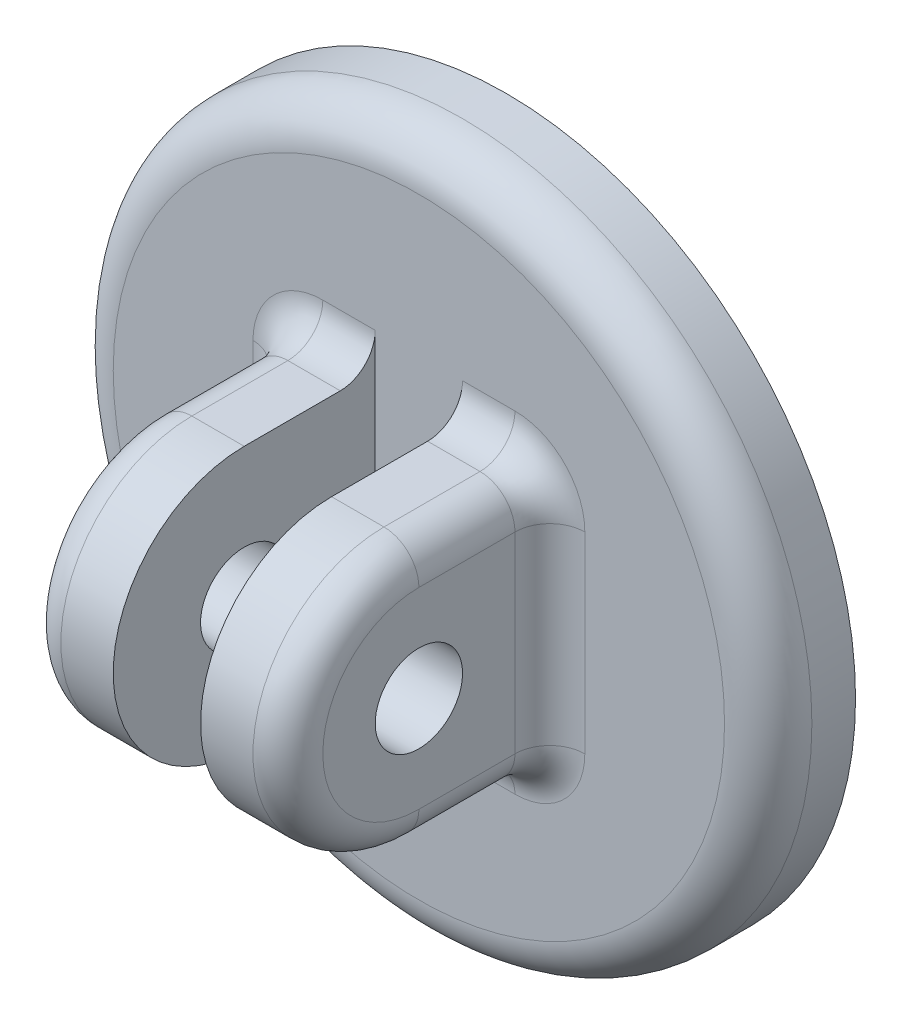
ISO-10303-21;
HEADER;
FILE_DESCRIPTION(('STEP AP214'),'2;1');
FILE_NAME('part.step','',(''),(''),'','','');
FILE_SCHEMA(('AUTOMOTIVE_DESIGN { 1 0 10303 214 1 1 1 1 }'));
ENDSEC;
DATA;
#1=APPLICATION_CONTEXT('core data for automotive mechanical design processes');
#2=APPLICATION_PROTOCOL_DEFINITION('international standard','automotive_design',2000,#1);
#3=PRODUCT_CONTEXT('',#1,'mechanical');
#4=PRODUCT('Part','Part','',(#3));
#5=PRODUCT_RELATED_PRODUCT_CATEGORY('part','',(#4));
#6=PRODUCT_DEFINITION_FORMATION('','',#4);
#7=PRODUCT_DEFINITION_CONTEXT('part definition',#1,'design');
#8=PRODUCT_DEFINITION('design','',#6,#7);
#9=PRODUCT_DEFINITION_SHAPE('','',#8);
#10=(LENGTH_UNIT() NAMED_UNIT(*) SI_UNIT(.MILLI.,.METRE.));
#11=(NAMED_UNIT(*) PLANE_ANGLE_UNIT() SI_UNIT($,.RADIAN.));
#12=(NAMED_UNIT(*) SI_UNIT($,.STERADIAN.) SOLID_ANGLE_UNIT());
#13=UNCERTAINTY_MEASURE_WITH_UNIT(LENGTH_MEASURE(1.E-05),#10,'distance_accuracy_value','');
#14=(GEOMETRIC_REPRESENTATION_CONTEXT(3) GLOBAL_UNCERTAINTY_ASSIGNED_CONTEXT((#13)) GLOBAL_UNIT_ASSIGNED_CONTEXT((#10,
#11,#12)) REPRESENTATION_CONTEXT('',''));
#15=CARTESIAN_POINT('',(0.,0.,0.));
#16=DIRECTION('',(0.,0.,1.));
#17=DIRECTION('',(1.,0.,0.));
#18=AXIS2_PLACEMENT_3D('',#15,#16,#17);
#19=CARTESIAN_POINT('',(0.,0.,5.));
#20=DIRECTION('',(0.,0.,1.));
#21=DIRECTION('',(1.,0.,0.));
#22=AXIS2_PLACEMENT_3D('',#19,#20,#21);
#23=PLANE('',#22);
#24=CARTESIAN_POINT('',(0.,0.,5.));
#25=DIRECTION('',(0.,0.,1.));
#26=DIRECTION('',(1.,0.,0.));
#27=AXIS2_PLACEMENT_3D('',#24,#25,#26);
#28=CIRCLE('',#27,17.5);
#29=CARTESIAN_POINT('',(17.5,0.,5.));
#30=VERTEX_POINT('',#29);
#31=EDGE_CURVE('E91',#30,#30,#28,.T.);
#32=ORIENTED_EDGE('',*,*,#31,.T.);
#33=EDGE_LOOP('',(#32));
#34=FACE_BOUND('',#33,.T.);
#35=DIRECTION('',(1.,0.,0.));
#36=VECTOR('',#35,1.);
#37=CARTESIAN_POINT('',(0.,9.5,5.));
#38=LINE('',#37,#36);
#39=CARTESIAN_POINT('',(-5.5,9.5,5.));
#40=VERTEX_POINT('',#39);
#41=CARTESIAN_POINT('',(-2.5,9.5,5.));
#42=VERTEX_POINT('',#41);
#43=EDGE_CURVE('E340',#40,#42,#38,.T.);
#44=ORIENTED_EDGE('',*,*,#43,.T.);
#45=DIRECTION('',(0.,-1.,0.));
#46=VECTOR('',#45,1.);
#47=CARTESIAN_POINT('',(-2.5,-7.5,5.));
#48=LINE('',#47,#46);
#49=CARTESIAN_POINT('',(-2.5,0.,5.));
#50=VERTEX_POINT('',#49);
#51=EDGE_CURVE('E236',#42,#50,#48,.T.);
#52=ORIENTED_EDGE('',*,*,#51,.T.);
#53=CARTESIAN_POINT('',(0.,0.,5.));
#54=DIRECTION('',(0.,0.,1.));
#55=DIRECTION('',(1.,0.,0.));
#56=AXIS2_PLACEMENT_3D('',#53,#54,#55);
#57=CIRCLE('',#56,2.5);
#58=CARTESIAN_POINT('',(2.5,0.,5.));
#59=VERTEX_POINT('',#58);
#60=EDGE_CURVE('E294',#59,#50,#57,.T.);
#61=ORIENTED_EDGE('',*,*,#60,.F.);
#62=DIRECTION('',(0.,-1.,0.));
#63=VECTOR('',#62,1.);
#64=CARTESIAN_POINT('',(2.5,-7.5,5.));
#65=LINE('',#64,#63);
#66=CARTESIAN_POINT('',(2.5,9.5,5.));
#67=VERTEX_POINT('',#66);
#68=EDGE_CURVE('E275',#67,#59,#65,.T.);
#69=ORIENTED_EDGE('',*,*,#68,.F.);
#70=DIRECTION('',(-1.,0.,0.));
#71=VECTOR('',#70,1.);
#72=CARTESIAN_POINT('',(0.,9.5,5.));
#73=LINE('',#72,#71);
#74=CARTESIAN_POINT('',(5.5,9.5,5.));
#75=VERTEX_POINT('',#74);
#76=EDGE_CURVE('E323',#67,#75,#73,.F.);
#77=ORIENTED_EDGE('',*,*,#76,.T.);
#78=CARTESIAN_POINT('',(5.5,5.5,5.));
#79=DIRECTION('',(0.,0.,1.));
#80=DIRECTION('',(1.,0.,0.));
#81=AXIS2_PLACEMENT_3D('',#78,#79,#80);
#82=CIRCLE('',#81,4.);
#83=CARTESIAN_POINT('',(9.5,5.5,5.));
#84=VERTEX_POINT('',#83);
#85=EDGE_CURVE('E319',#84,#75,#82,.T.);
#86=ORIENTED_EDGE('',*,*,#85,.F.);
#87=DIRECTION('',(0.,1.,0.));
#88=VECTOR('',#87,1.);
#89=CARTESIAN_POINT('',(9.5,0.,5.));
#90=LINE('',#89,#88);
#91=CARTESIAN_POINT('',(9.5,-5.5,5.));
#92=VERTEX_POINT('',#91);
#93=EDGE_CURVE('E316',#84,#92,#90,.F.);
#94=ORIENTED_EDGE('',*,*,#93,.T.);
#95=CARTESIAN_POINT('',(5.5,-5.5,5.));
#96=DIRECTION('',(0.,0.,1.));
#97=DIRECTION('',(1.,0.,0.));
#98=AXIS2_PLACEMENT_3D('',#95,#96,#97);
#99=CIRCLE('',#98,4.);
#100=CARTESIAN_POINT('',(5.5,-9.5,5.));
#101=VERTEX_POINT('',#100);
#102=EDGE_CURVE('E312',#101,#92,#99,.T.);
#103=ORIENTED_EDGE('',*,*,#102,.F.);
#104=DIRECTION('',(1.,0.,0.));
#105=VECTOR('',#104,1.);
#106=CARTESIAN_POINT('',(0.,-9.5,5.));
#107=LINE('',#106,#105);
#108=CARTESIAN_POINT('',(2.5,-9.5,5.));
#109=VERTEX_POINT('',#108);
#110=EDGE_CURVE('E308',#101,#109,#107,.F.);
#111=ORIENTED_EDGE('',*,*,#110,.T.);
#112=EDGE_CURVE('E280',#59,#109,#65,.T.);
#113=ORIENTED_EDGE('',*,*,#112,.F.);
#114=EDGE_CURVE('E288',#50,#59,#57,.T.);
#115=ORIENTED_EDGE('',*,*,#114,.F.);
#116=CARTESIAN_POINT('',(-2.5,-9.5,5.));
#117=VERTEX_POINT('',#116);
#118=EDGE_CURVE('E252',#50,#117,#48,.T.);
#119=ORIENTED_EDGE('',*,*,#118,.T.);
#120=DIRECTION('',(-1.,0.,0.));
#121=VECTOR('',#120,1.);
#122=CARTESIAN_POINT('',(0.,-9.5,5.));
#123=LINE('',#122,#121);
#124=CARTESIAN_POINT('',(-5.5,-9.5,5.));
#125=VERTEX_POINT('',#124);
#126=EDGE_CURVE('E326',#117,#125,#123,.T.);
#127=ORIENTED_EDGE('',*,*,#126,.T.);
#128=CARTESIAN_POINT('',(-5.5,-5.5,5.));
#129=DIRECTION('',(0.,0.,1.));
#130=DIRECTION('',(1.,0.,0.));
#131=AXIS2_PLACEMENT_3D('',#128,#129,#130);
#132=CIRCLE('',#131,4.);
#133=CARTESIAN_POINT('',(-9.5,-5.5,5.));
#134=VERTEX_POINT('',#133);
#135=EDGE_CURVE('E329',#134,#125,#132,.T.);
#136=ORIENTED_EDGE('',*,*,#135,.F.);
#137=DIRECTION('',(0.,1.,0.));
#138=VECTOR('',#137,1.);
#139=CARTESIAN_POINT('',(-9.5,0.,5.));
#140=LINE('',#139,#138);
#141=CARTESIAN_POINT('',(-9.5,5.5,5.));
#142=VERTEX_POINT('',#141);
#143=EDGE_CURVE('E333',#134,#142,#140,.T.);
#144=ORIENTED_EDGE('',*,*,#143,.T.);
#145=CARTESIAN_POINT('',(-5.5,5.5,5.));
#146=DIRECTION('',(0.,0.,1.));
#147=DIRECTION('',(1.,0.,0.));
#148=AXIS2_PLACEMENT_3D('',#145,#146,#147);
#149=CIRCLE('',#148,4.);
#150=EDGE_CURVE('E336',#40,#142,#149,.T.);
#151=ORIENTED_EDGE('',*,*,#150,.F.);
#152=EDGE_LOOP('',(#44,#52,#61,#69,#77,#86,#94,#103,#111,#113,#115,#119,#127,#136,#144,#151));
#153=FACE_BOUND('',#152,.T.);
#154=ADVANCED_FACE('F82',(#34,#153),#23,.T.);
#155=CARTESIAN_POINT('',(2.5,-7.5,20.));
#156=DIRECTION('',(1.,0.,0.));
#157=DIRECTION('',(0.,0.,-1.));
#158=AXIS2_PLACEMENT_3D('',#155,#156,#157);
#159=PLANE('',#158);
#160=CARTESIAN_POINT('',(2.5,0.,12.5));
#161=DIRECTION('',(1.,0.,0.));
#162=DIRECTION('',(0.,1.,0.));
#163=AXIS2_PLACEMENT_3D('',#160,#161,#162);
#164=CIRCLE('',#163,2.5);
#165=CARTESIAN_POINT('',(2.5,2.5,12.5));
#166=VERTEX_POINT('',#165);
#167=EDGE_CURVE('E260',#166,#166,#164,.T.);
#168=ORIENTED_EDGE('',*,*,#167,.T.);
#169=EDGE_LOOP('',(#168));
#170=FACE_BOUND('',#169,.T.);
#171=CARTESIAN_POINT('',(2.5,0.,12.5));
#172=DIRECTION('',(1.,0.,0.));
#173=DIRECTION('',(0.,1.,0.));
#174=AXIS2_PLACEMENT_3D('',#171,#172,#173);
#175=CIRCLE('',#174,7.5);
#176=CARTESIAN_POINT('',(2.5,7.5,12.5));
#177=VERTEX_POINT('',#176);
#178=CARTESIAN_POINT('',(2.5,-7.5,12.5));
#179=VERTEX_POINT('',#178);
#180=EDGE_CURVE('E265',#177,#179,#175,.T.);
#181=ORIENTED_EDGE('',*,*,#180,.F.);
#182=DIRECTION('',(0.,0.,-1.));
#183=VECTOR('',#182,1.);
#184=CARTESIAN_POINT('',(2.5,7.5,20.));
#185=LINE('',#184,#183);
#186=CARTESIAN_POINT('',(2.5,7.5,7.));
#187=VERTEX_POINT('',#186);
#188=EDGE_CURVE('E279',#177,#187,#185,.T.);
#189=ORIENTED_EDGE('',*,*,#188,.T.);
#190=CARTESIAN_POINT('',(2.5,9.5,7.));
#191=DIRECTION('',(1.,0.,0.));
#192=DIRECTION('',(0.,0.,-1.));
#193=AXIS2_PLACEMENT_3D('',#190,#191,#192);
#194=CIRCLE('',#193,2.);
#195=EDGE_CURVE('E391',#187,#67,#194,.T.);
#196=ORIENTED_EDGE('',*,*,#195,.T.);
#197=ORIENTED_EDGE('',*,*,#68,.T.);
#198=ORIENTED_EDGE('',*,*,#112,.T.);
#199=CARTESIAN_POINT('',(2.5,-9.5,7.));
#200=DIRECTION('',(1.,0.,0.));
#201=DIRECTION('',(0.,0.,-1.));
#202=AXIS2_PLACEMENT_3D('',#199,#200,#201);
#203=CIRCLE('',#202,2.);
#204=CARTESIAN_POINT('',(2.5,-7.5,7.));
#205=VERTEX_POINT('',#204);
#206=EDGE_CURVE('E401',#109,#205,#203,.T.);
#207=ORIENTED_EDGE('',*,*,#206,.T.);
#208=DIRECTION('',(0.,0.,-1.));
#209=VECTOR('',#208,1.);
#210=CARTESIAN_POINT('',(2.5,-7.5,20.));
#211=LINE('',#210,#209);
#212=EDGE_CURVE('E284',#179,#205,#211,.T.);
#213=ORIENTED_EDGE('',*,*,#212,.F.);
#214=EDGE_LOOP('',(#181,#189,#196,#197,#198,#207,#213));
#215=FACE_BOUND('',#214,.T.);
#216=ADVANCED_FACE('F481',(#170,#215),#159,.F.);
#217=CARTESIAN_POINT('',(7.5,-7.5,20.));
#218=DIRECTION('',(-1.,0.,0.));
#219=DIRECTION('',(0.,-1.,0.));
#220=AXIS2_PLACEMENT_3D('',#217,#218,#219);
#221=PLANE('',#220);
#222=DIRECTION('',(0.,0.,-1.));
#223=VECTOR('',#222,1.);
#224=CARTESIAN_POINT('',(7.5,-5.5,20.));
#225=LINE('',#224,#223);
#226=CARTESIAN_POINT('',(7.5,-5.5,12.5));
#227=VERTEX_POINT('',#226);
#228=CARTESIAN_POINT('',(7.5,-5.5,7.));
#229=VERTEX_POINT('',#228);
#230=EDGE_CURVE('E352',#227,#229,#225,.T.);
#231=ORIENTED_EDGE('',*,*,#230,.T.);
#232=DIRECTION('',(0.,1.,0.));
#233=VECTOR('',#232,1.);
#234=CARTESIAN_POINT('',(7.5,-7.5,7.));
#235=LINE('',#234,#233);
#236=CARTESIAN_POINT('',(7.5,5.5,7.));
#237=VERTEX_POINT('',#236);
#238=EDGE_CURVE('E358',#229,#237,#235,.T.);
#239=ORIENTED_EDGE('',*,*,#238,.T.);
#240=DIRECTION('',(0.,0.,-1.));
#241=VECTOR('',#240,1.);
#242=CARTESIAN_POINT('',(7.5,5.5,20.));
#243=LINE('',#242,#241);
#244=CARTESIAN_POINT('',(7.5,5.5,12.5));
#245=VERTEX_POINT('',#244);
#246=EDGE_CURVE('E355',#237,#245,#243,.F.);
#247=ORIENTED_EDGE('',*,*,#246,.T.);
#248=CARTESIAN_POINT('',(7.5,0.,12.5));
#249=DIRECTION('',(-1.,0.,0.));
#250=DIRECTION('',(0.,-1.,0.));
#251=AXIS2_PLACEMENT_3D('',#248,#249,#250);
#252=CIRCLE('',#251,5.5);
#253=EDGE_CURVE('E349',#245,#227,#252,.F.);
#254=ORIENTED_EDGE('',*,*,#253,.T.);
#255=EDGE_LOOP('',(#231,#239,#247,#254));
#256=FACE_BOUND('',#255,.T.);
#257=CARTESIAN_POINT('',(7.5,0.,12.5));
#258=DIRECTION('',(1.,0.,0.));
#259=DIRECTION('',(0.,1.,0.));
#260=AXIS2_PLACEMENT_3D('',#257,#258,#259);
#261=CIRCLE('',#260,2.5);
#262=CARTESIAN_POINT('',(7.5,2.5,12.5));
#263=VERTEX_POINT('',#262);
#264=EDGE_CURVE('E261',#263,#263,#261,.T.);
#265=ORIENTED_EDGE('',*,*,#264,.F.);
#266=EDGE_LOOP('',(#265));
#267=FACE_BOUND('',#266,.T.);
#268=ADVANCED_FACE('F486',(#256,#267),#221,.F.);
#269=CARTESIAN_POINT('',(2.5,-7.5,20.));
#270=DIRECTION('',(0.,1.,0.));
#271=DIRECTION('',(-1.,0.,0.));
#272=AXIS2_PLACEMENT_3D('',#269,#270,#271);
#273=PLANE('',#272);
#274=DIRECTION('',(1.,0.,0.));
#275=VECTOR('',#274,1.);
#276=CARTESIAN_POINT('',(2.5,-7.5,7.));
#277=LINE('',#276,#275);
#278=CARTESIAN_POINT('',(5.5,-7.5,7.));
#279=VERTEX_POINT('',#278);
#280=EDGE_CURVE('E375',#205,#279,#277,.T.);
#281=ORIENTED_EDGE('',*,*,#280,.T.);
#282=DIRECTION('',(0.,0.,-1.));
#283=VECTOR('',#282,1.);
#284=CARTESIAN_POINT('',(5.5,-7.5,20.));
#285=LINE('',#284,#283);
#286=CARTESIAN_POINT('',(5.5,-7.5,12.5));
#287=VERTEX_POINT('',#286);
#288=EDGE_CURVE('E378',#279,#287,#285,.F.);
#289=ORIENTED_EDGE('',*,*,#288,.T.);
#290=DIRECTION('',(1.,0.,0.));
#291=VECTOR('',#290,1.);
#292=CARTESIAN_POINT('',(2.5,-7.5,12.5));
#293=LINE('',#292,#291);
#294=EDGE_CURVE('E271',#179,#287,#293,.T.);
#295=ORIENTED_EDGE('',*,*,#294,.F.);
#296=ORIENTED_EDGE('',*,*,#212,.T.);
#297=EDGE_LOOP('',(#281,#289,#295,#296));
#298=FACE_BOUND('',#297,.T.);
#299=ADVANCED_FACE('F499',(#298),#273,.F.);
#300=CARTESIAN_POINT('',(0.,0.,5.));
#301=DIRECTION('',(0.,0.,-1.));
#302=DIRECTION('',(-1.,0.,0.));
#303=AXIS2_PLACEMENT_3D('',#300,#301,#302);
#304=CYLINDRICAL_SURFACE('',#303,20.);
#305=CARTESIAN_POINT('',(0.,0.,2.5));
#306=DIRECTION('',(0.,0.,1.));
#307=DIRECTION('',(1.,0.,0.));
#308=AXIS2_PLACEMENT_3D('',#305,#306,#307);
#309=CIRCLE('',#308,20.);
#310=CARTESIAN_POINT('',(20.,0.,2.5));
#311=VERTEX_POINT('',#310);
#312=EDGE_CURVE('E12',#311,#311,#309,.F.);
#313=ORIENTED_EDGE('',*,*,#312,.T.);
#314=EDGE_LOOP('',(#313));
#315=FACE_BOUND('',#314,.T.);
#316=CARTESIAN_POINT('',(0.,0.,0.));
#317=DIRECTION('',(0.,0.,1.));
#318=DIRECTION('',(1.,0.,0.));
#319=AXIS2_PLACEMENT_3D('',#316,#317,#318);
#320=CIRCLE('',#319,20.);
#321=CARTESIAN_POINT('',(20.,0.,0.));
#322=VERTEX_POINT('',#321);
#323=EDGE_CURVE('E293',#322,#322,#320,.T.);
#324=ORIENTED_EDGE('',*,*,#323,.T.);
#325=EDGE_LOOP('',(#324));
#326=FACE_BOUND('',#325,.T.);
#327=ADVANCED_FACE('F495',(#315,#326),#304,.T.);
#328=CARTESIAN_POINT('',(0.,0.,0.));
#329=DIRECTION('',(0.,0.,1.));
#330=DIRECTION('',(1.,0.,0.));
#331=AXIS2_PLACEMENT_3D('',#328,#329,#330);
#332=PLANE('',#331);
#333=CARTESIAN_POINT('',(0.,0.,0.));
#334=DIRECTION('',(0.,0.,1.));
#335=DIRECTION('',(1.,0.,0.));
#336=AXIS2_PLACEMENT_3D('',#333,#334,#335);
#337=CIRCLE('',#336,2.5);
#338=CARTESIAN_POINT('',(2.5,0.,0.));
#339=VERTEX_POINT('',#338);
#340=EDGE_CURVE('E289',#339,#339,#337,.T.);
#341=ORIENTED_EDGE('',*,*,#340,.T.);
#342=EDGE_LOOP('',(#341));
#343=FACE_BOUND('',#342,.T.);
#344=ORIENTED_EDGE('',*,*,#323,.F.);
#345=EDGE_LOOP('',(#344));
#346=FACE_BOUND('',#345,.T.);
#347=ADVANCED_FACE('F492',(#343,#346),#332,.F.);
#348=CARTESIAN_POINT('',(0.,0.,0.));
#349=DIRECTION('',(0.,0.,1.));
#350=DIRECTION('',(1.,0.,0.));
#351=AXIS2_PLACEMENT_3D('',#348,#349,#350);
#352=CYLINDRICAL_SURFACE('',#351,2.5);
#353=ORIENTED_EDGE('',*,*,#340,.F.);
#354=EDGE_LOOP('',(#353));
#355=FACE_BOUND('',#354,.T.);
#356=ORIENTED_EDGE('',*,*,#60,.T.);
#357=ORIENTED_EDGE('',*,*,#114,.T.);
#358=EDGE_LOOP('',(#356,#357));
#359=FACE_BOUND('',#358,.T.);
#360=ADVANCED_FACE('F491',(#355,#359),#352,.F.);
#361=CARTESIAN_POINT('',(2.5,7.5,20.));
#362=DIRECTION('',(0.,-1.,0.));
#363=DIRECTION('',(1.,0.,0.));
#364=AXIS2_PLACEMENT_3D('',#361,#362,#363);
#365=PLANE('',#364);
#366=DIRECTION('',(0.,0.,-1.));
#367=VECTOR('',#366,1.);
#368=CARTESIAN_POINT('',(5.5,7.5,20.));
#369=LINE('',#368,#367);
#370=CARTESIAN_POINT('',(5.5,7.5,12.5));
#371=VERTEX_POINT('',#370);
#372=CARTESIAN_POINT('',(5.5,7.5,7.));
#373=VERTEX_POINT('',#372);
#374=EDGE_CURVE('E301',#371,#373,#369,.T.);
#375=ORIENTED_EDGE('',*,*,#374,.T.);
#376=DIRECTION('',(-1.,0.,0.));
#377=VECTOR('',#376,1.);
#378=CARTESIAN_POINT('',(2.5,7.5,7.));
#379=LINE('',#378,#377);
#380=EDGE_CURVE('E304',#373,#187,#379,.T.);
#381=ORIENTED_EDGE('',*,*,#380,.T.);
#382=ORIENTED_EDGE('',*,*,#188,.F.);
#383=DIRECTION('',(1.,0.,0.));
#384=VECTOR('',#383,1.);
#385=CARTESIAN_POINT('',(2.5,7.5,12.5));
#386=LINE('',#385,#384);
#387=EDGE_CURVE('E256',#177,#371,#386,.T.);
#388=ORIENTED_EDGE('',*,*,#387,.T.);
#389=EDGE_LOOP('',(#375,#381,#382,#388));
#390=FACE_BOUND('',#389,.T.);
#391=ADVANCED_FACE('F590',(#390),#365,.F.);
#392=CARTESIAN_POINT('',(2.5,0.,12.5));
#393=DIRECTION('',(1.,0.,0.));
#394=DIRECTION('',(0.,1.,0.));
#395=AXIS2_PLACEMENT_3D('',#392,#393,#394);
#396=CYLINDRICAL_SURFACE('',#395,7.5);
#397=ORIENTED_EDGE('',*,*,#294,.T.);
#398=CARTESIAN_POINT('',(5.5,0.,12.5));
#399=DIRECTION('',(-1.,0.,0.));
#400=DIRECTION('',(0.,-1.,0.));
#401=AXIS2_PLACEMENT_3D('',#398,#399,#400);
#402=CIRCLE('',#401,7.5);
#403=EDGE_CURVE('E385',#287,#371,#402,.T.);
#404=ORIENTED_EDGE('',*,*,#403,.T.);
#405=ORIENTED_EDGE('',*,*,#387,.F.);
#406=ORIENTED_EDGE('',*,*,#180,.T.);
#407=EDGE_LOOP('',(#397,#404,#405,#406));
#408=FACE_BOUND('',#407,.T.);
#409=ADVANCED_FACE('F586',(#408),#396,.T.);
#410=CARTESIAN_POINT('',(2.5,0.,12.5));
#411=DIRECTION('',(1.,0.,0.));
#412=DIRECTION('',(0.,1.,0.));
#413=AXIS2_PLACEMENT_3D('',#410,#411,#412);
#414=CYLINDRICAL_SURFACE('',#413,2.5);
#415=ORIENTED_EDGE('',*,*,#167,.F.);
#416=EDGE_LOOP('',(#415));
#417=FACE_BOUND('',#416,.T.);
#418=ORIENTED_EDGE('',*,*,#264,.T.);
#419=EDGE_LOOP('',(#418));
#420=FACE_BOUND('',#419,.T.);
#421=ADVANCED_FACE('F582',(#417,#420),#414,.F.);
#422=CARTESIAN_POINT('',(-2.5,-7.5,20.));
#423=DIRECTION('',(-1.,0.,0.));
#424=DIRECTION('',(0.,0.,-1.));
#425=AXIS2_PLACEMENT_3D('',#422,#423,#424);
#426=PLANE('',#425);
#427=CARTESIAN_POINT('',(-2.5,0.,12.5));
#428=DIRECTION('',(1.,0.,0.));
#429=DIRECTION('',(0.,1.,0.));
#430=AXIS2_PLACEMENT_3D('',#427,#428,#429);
#431=CIRCLE('',#430,2.5);
#432=CARTESIAN_POINT('',(-2.5,2.5,12.5));
#433=VERTEX_POINT('',#432);
#434=EDGE_CURVE('E225',#433,#433,#431,.T.);
#435=ORIENTED_EDGE('',*,*,#434,.F.);
#436=EDGE_LOOP('',(#435));
#437=FACE_BOUND('',#436,.T.);
#438=CARTESIAN_POINT('',(-2.5,0.,12.5));
#439=DIRECTION('',(1.,0.,0.));
#440=DIRECTION('',(0.,1.,0.));
#441=AXIS2_PLACEMENT_3D('',#438,#439,#440);
#442=CIRCLE('',#441,7.5);
#443=CARTESIAN_POINT('',(-2.5,7.5,12.5));
#444=VERTEX_POINT('',#443);
#445=CARTESIAN_POINT('',(-2.5,-7.5,12.5));
#446=VERTEX_POINT('',#445);
#447=EDGE_CURVE('E231',#444,#446,#442,.T.);
#448=ORIENTED_EDGE('',*,*,#447,.T.);
#449=DIRECTION('',(0.,0.,-1.));
#450=VECTOR('',#449,1.);
#451=CARTESIAN_POINT('',(-2.5,-7.5,20.));
#452=LINE('',#451,#450);
#453=CARTESIAN_POINT('',(-2.5,-7.5,7.));
#454=VERTEX_POINT('',#453);
#455=EDGE_CURVE('E235',#446,#454,#452,.T.);
#456=ORIENTED_EDGE('',*,*,#455,.T.);
#457=CARTESIAN_POINT('',(-2.5,-9.5,7.));
#458=DIRECTION('',(-1.,0.,0.));
#459=DIRECTION('',(0.,0.,1.));
#460=AXIS2_PLACEMENT_3D('',#457,#458,#459);
#461=CIRCLE('',#460,2.);
#462=EDGE_CURVE('E397',#454,#117,#461,.T.);
#463=ORIENTED_EDGE('',*,*,#462,.T.);
#464=ORIENTED_EDGE('',*,*,#118,.F.);
#465=ORIENTED_EDGE('',*,*,#51,.F.);
#466=CARTESIAN_POINT('',(-2.5,9.5,7.));
#467=DIRECTION('',(-1.,0.,0.));
#468=DIRECTION('',(0.,0.,1.));
#469=AXIS2_PLACEMENT_3D('',#466,#467,#468);
#470=CIRCLE('',#469,2.);
#471=CARTESIAN_POINT('',(-2.5,7.5,7.));
#472=VERTEX_POINT('',#471);
#473=EDGE_CURVE('E233',#42,#472,#470,.T.);
#474=ORIENTED_EDGE('',*,*,#473,.T.);
#475=DIRECTION('',(0.,0.,-1.));
#476=VECTOR('',#475,1.);
#477=CARTESIAN_POINT('',(-2.5,7.5,20.));
#478=LINE('',#477,#476);
#479=EDGE_CURVE('E217',#444,#472,#478,.T.);
#480=ORIENTED_EDGE('',*,*,#479,.F.);
#481=EDGE_LOOP('',(#448,#456,#463,#464,#465,#474,#480));
#482=FACE_BOUND('',#481,.T.);
#483=ADVANCED_FACE('F230',(#437,#482),#426,.F.);
#484=CARTESIAN_POINT('',(-7.5,-7.5,20.));
#485=DIRECTION('',(1.,0.,0.));
#486=DIRECTION('',(0.,-1.,0.));
#487=AXIS2_PLACEMENT_3D('',#484,#485,#486);
#488=PLANE('',#487);
#489=DIRECTION('',(0.,0.,-1.));
#490=VECTOR('',#489,1.);
#491=CARTESIAN_POINT('',(-7.5,5.5,20.));
#492=LINE('',#491,#490);
#493=CARTESIAN_POINT('',(-7.5,5.5,12.5));
#494=VERTEX_POINT('',#493);
#495=CARTESIAN_POINT('',(-7.5,5.5,7.));
#496=VERTEX_POINT('',#495);
#497=EDGE_CURVE('E368',#494,#496,#492,.T.);
#498=ORIENTED_EDGE('',*,*,#497,.T.);
#499=DIRECTION('',(0.,1.,0.));
#500=VECTOR('',#499,1.);
#501=CARTESIAN_POINT('',(-7.5,-7.5,7.));
#502=LINE('',#501,#500);
#503=CARTESIAN_POINT('',(-7.5,-5.5,7.));
#504=VERTEX_POINT('',#503);
#505=EDGE_CURVE('E371',#496,#504,#502,.F.);
#506=ORIENTED_EDGE('',*,*,#505,.T.);
#507=DIRECTION('',(0.,0.,-1.));
#508=VECTOR('',#507,1.);
#509=CARTESIAN_POINT('',(-7.5,-5.5,20.));
#510=LINE('',#509,#508);
#511=CARTESIAN_POINT('',(-7.5,-5.5,12.5));
#512=VERTEX_POINT('',#511);
#513=EDGE_CURVE('E365',#504,#512,#510,.F.);
#514=ORIENTED_EDGE('',*,*,#513,.T.);
#515=CARTESIAN_POINT('',(-7.5,0.,12.5));
#516=DIRECTION('',(1.,0.,0.));
#517=DIRECTION('',(0.,1.,0.));
#518=AXIS2_PLACEMENT_3D('',#515,#516,#517);
#519=CIRCLE('',#518,5.5);
#520=EDGE_CURVE('E362',#512,#494,#519,.F.);
#521=ORIENTED_EDGE('',*,*,#520,.T.);
#522=EDGE_LOOP('',(#498,#506,#514,#521));
#523=FACE_BOUND('',#522,.T.);
#524=CARTESIAN_POINT('',(-7.5,0.,12.5));
#525=DIRECTION('',(1.,0.,0.));
#526=DIRECTION('',(0.,1.,0.));
#527=AXIS2_PLACEMENT_3D('',#524,#525,#526);
#528=CIRCLE('',#527,2.5);
#529=CARTESIAN_POINT('',(-7.5,2.5,12.5));
#530=VERTEX_POINT('',#529);
#531=EDGE_CURVE('E241',#530,#530,#528,.T.);
#532=ORIENTED_EDGE('',*,*,#531,.T.);
#533=EDGE_LOOP('',(#532));
#534=FACE_BOUND('',#533,.T.);
#535=ADVANCED_FACE('F570',(#523,#534),#488,.F.);
#536=CARTESIAN_POINT('',(-2.5,-7.5,20.));
#537=DIRECTION('',(0.,1.,0.));
#538=DIRECTION('',(1.,0.,0.));
#539=AXIS2_PLACEMENT_3D('',#536,#537,#538);
#540=PLANE('',#539);
#541=DIRECTION('',(-1.,0.,0.));
#542=VECTOR('',#541,1.);
#543=CARTESIAN_POINT('',(-2.5,-7.5,12.5));
#544=LINE('',#543,#542);
#545=CARTESIAN_POINT('',(-5.5,-7.5,12.5));
#546=VERTEX_POINT('',#545);
#547=EDGE_CURVE('E239',#446,#546,#544,.T.);
#548=ORIENTED_EDGE('',*,*,#547,.T.);
#549=DIRECTION('',(0.,0.,-1.));
#550=VECTOR('',#549,1.);
#551=CARTESIAN_POINT('',(-5.5,-7.5,20.));
#552=LINE('',#551,#550);
#553=CARTESIAN_POINT('',(-5.5,-7.5,7.));
#554=VERTEX_POINT('',#553);
#555=EDGE_CURVE('E98',#546,#554,#552,.T.);
#556=ORIENTED_EDGE('',*,*,#555,.T.);
#557=DIRECTION('',(-1.,0.,0.));
#558=VECTOR('',#557,1.);
#559=CARTESIAN_POINT('',(-2.5,-7.5,7.));
#560=LINE('',#559,#558);
#561=EDGE_CURVE('E102',#554,#454,#560,.F.);
#562=ORIENTED_EDGE('',*,*,#561,.T.);
#563=ORIENTED_EDGE('',*,*,#455,.F.);
#564=EDGE_LOOP('',(#548,#556,#562,#563));
#565=FACE_BOUND('',#564,.T.);
#566=ADVANCED_FACE('F568',(#565),#540,.F.);
#567=CARTESIAN_POINT('',(-2.5,7.5,20.));
#568=DIRECTION('',(0.,-1.,0.));
#569=DIRECTION('',(-1.,0.,0.));
#570=AXIS2_PLACEMENT_3D('',#567,#568,#569);
#571=PLANE('',#570);
#572=ORIENTED_EDGE('',*,*,#479,.T.);
#573=DIRECTION('',(1.,0.,0.));
#574=VECTOR('',#573,1.);
#575=CARTESIAN_POINT('',(-2.5,7.5,7.));
#576=LINE('',#575,#574);
#577=CARTESIAN_POINT('',(-5.5,7.5,7.));
#578=VERTEX_POINT('',#577);
#579=EDGE_CURVE('E346',#472,#578,#576,.F.);
#580=ORIENTED_EDGE('',*,*,#579,.T.);
#581=DIRECTION('',(0.,0.,-1.));
#582=VECTOR('',#581,1.);
#583=CARTESIAN_POINT('',(-5.5,7.5,20.));
#584=LINE('',#583,#582);
#585=CARTESIAN_POINT('',(-5.5,7.5,12.5));
#586=VERTEX_POINT('',#585);
#587=EDGE_CURVE('E220',#578,#586,#584,.F.);
#588=ORIENTED_EDGE('',*,*,#587,.T.);
#589=DIRECTION('',(-1.,0.,0.));
#590=VECTOR('',#589,1.);
#591=CARTESIAN_POINT('',(-2.5,7.5,12.5));
#592=LINE('',#591,#590);
#593=EDGE_CURVE('E214',#444,#586,#592,.T.);
#594=ORIENTED_EDGE('',*,*,#593,.F.);
#595=EDGE_LOOP('',(#572,#580,#588,#594));
#596=FACE_BOUND('',#595,.T.);
#597=ADVANCED_FACE('F216',(#596),#571,.F.);
#598=CARTESIAN_POINT('',(-2.5,0.,12.5));
#599=DIRECTION('',(-1.,0.,0.));
#600=DIRECTION('',(0.,1.,0.));
#601=AXIS2_PLACEMENT_3D('',#598,#599,#600);
#602=CYLINDRICAL_SURFACE('',#601,7.5);
#603=ORIENTED_EDGE('',*,*,#593,.T.);
#604=CARTESIAN_POINT('',(-5.5,0.,12.5));
#605=DIRECTION('',(1.,0.,0.));
#606=DIRECTION('',(0.,1.,0.));
#607=AXIS2_PLACEMENT_3D('',#604,#605,#606);
#608=CIRCLE('',#607,7.5);
#609=EDGE_CURVE('E388',#586,#546,#608,.T.);
#610=ORIENTED_EDGE('',*,*,#609,.T.);
#611=ORIENTED_EDGE('',*,*,#547,.F.);
#612=ORIENTED_EDGE('',*,*,#447,.F.);
#613=EDGE_LOOP('',(#603,#610,#611,#612));
#614=FACE_BOUND('',#613,.T.);
#615=ADVANCED_FACE('F238',(#614),#602,.T.);
#616=CARTESIAN_POINT('',(-2.5,0.,12.5));
#617=DIRECTION('',(-1.,0.,0.));
#618=DIRECTION('',(0.,1.,0.));
#619=AXIS2_PLACEMENT_3D('',#616,#617,#618);
#620=CYLINDRICAL_SURFACE('',#619,2.5);
#621=ORIENTED_EDGE('',*,*,#434,.T.);
#622=EDGE_LOOP('',(#621));
#623=FACE_BOUND('',#622,.T.);
#624=ORIENTED_EDGE('',*,*,#531,.F.);
#625=EDGE_LOOP('',(#624));
#626=FACE_BOUND('',#625,.T.);
#627=ADVANCED_FACE('F532',(#623,#626),#620,.F.);
#628=CARTESIAN_POINT('',(2.5,-9.5,7.));
#629=DIRECTION('',(1.,0.,0.));
#630=DIRECTION('',(0.,1.,0.));
#631=AXIS2_PLACEMENT_3D('',#628,#629,#630);
#632=CYLINDRICAL_SURFACE('',#631,2.);
#633=ORIENTED_EDGE('',*,*,#206,.F.);
#634=ORIENTED_EDGE('',*,*,#110,.F.);
#635=CARTESIAN_POINT('',(5.5,-9.5,7.));
#636=DIRECTION('',(-1.,0.,0.));
#637=DIRECTION('',(0.,0.,1.));
#638=AXIS2_PLACEMENT_3D('',#635,#636,#637);
#639=CIRCLE('',#638,2.);
#640=EDGE_CURVE('E226',#279,#101,#639,.T.);
#641=ORIENTED_EDGE('',*,*,#640,.F.);
#642=ORIENTED_EDGE('',*,*,#280,.F.);
#643=EDGE_LOOP('',(#633,#634,#641,#642));
#644=FACE_BOUND('',#643,.T.);
#645=ADVANCED_FACE('F529',(#644),#632,.F.);
#646=CARTESIAN_POINT('',(5.5,-5.5,20.));
#647=DIRECTION('',(0.,0.,-1.));
#648=DIRECTION('',(-1.,0.,0.));
#649=AXIS2_PLACEMENT_3D('',#646,#647,#648);
#650=CYLINDRICAL_SURFACE('',#649,2.);
#651=CARTESIAN_POINT('',(5.5,-5.5,12.5));
#652=DIRECTION('',(0.,0.,1.));
#653=DIRECTION('',(1.,0.,0.));
#654=AXIS2_PLACEMENT_3D('',#651,#652,#653);
#655=CIRCLE('',#654,2.);
#656=EDGE_CURVE('E424',#287,#227,#655,.T.);
#657=ORIENTED_EDGE('',*,*,#656,.F.);
#658=ORIENTED_EDGE('',*,*,#288,.F.);
#659=CARTESIAN_POINT('',(5.5,-5.5,7.));
#660=DIRECTION('',(0.,0.,1.));
#661=DIRECTION('',(1.,0.,0.));
#662=AXIS2_PLACEMENT_3D('',#659,#660,#661);
#663=CIRCLE('',#662,2.);
#664=EDGE_CURVE('E428',#229,#279,#663,.F.);
#665=ORIENTED_EDGE('',*,*,#664,.F.);
#666=ORIENTED_EDGE('',*,*,#230,.F.);
#667=EDGE_LOOP('',(#657,#658,#665,#666));
#668=FACE_BOUND('',#667,.T.);
#669=ADVANCED_FACE('F525',(#668),#650,.T.);
#670=CARTESIAN_POINT('',(5.5,-5.5,7.));
#671=DIRECTION('',(0.,0.,1.));
#672=DIRECTION('',(1.,0.,0.));
#673=AXIS2_PLACEMENT_3D('',#670,#671,#672);
#674=TOROIDAL_SURFACE('',#673,4.,2.);
#675=ORIENTED_EDGE('',*,*,#640,.T.);
#676=ORIENTED_EDGE('',*,*,#102,.T.);
#677=CARTESIAN_POINT('',(9.5,-5.5,7.));
#678=DIRECTION('',(0.,1.,0.));
#679=DIRECTION('',(-1.,0.,0.));
#680=AXIS2_PLACEMENT_3D('',#677,#678,#679);
#681=CIRCLE('',#680,2.);
#682=EDGE_CURVE('E420',#229,#92,#681,.F.);
#683=ORIENTED_EDGE('',*,*,#682,.F.);
#684=ORIENTED_EDGE('',*,*,#664,.T.);
#685=EDGE_LOOP('',(#675,#676,#683,#684));
#686=FACE_BOUND('',#685,.T.);
#687=ADVANCED_FACE('F521',(#686),#674,.F.);
#688=CARTESIAN_POINT('',(5.5,0.,12.5));
#689=DIRECTION('',(-1.,0.,0.));
#690=DIRECTION('',(0.,-1.,0.));
#691=AXIS2_PLACEMENT_3D('',#688,#689,#690);
#692=TOROIDAL_SURFACE('',#691,5.5,2.);
#693=ORIENTED_EDGE('',*,*,#656,.T.);
#694=ORIENTED_EDGE('',*,*,#253,.F.);
#695=CARTESIAN_POINT('',(5.5,5.5,12.5));
#696=DIRECTION('',(0.,0.,-1.));
#697=DIRECTION('',(-1.,0.,0.));
#698=AXIS2_PLACEMENT_3D('',#695,#696,#697);
#699=CIRCLE('',#698,2.);
#700=EDGE_CURVE('E416',#371,#245,#699,.T.);
#701=ORIENTED_EDGE('',*,*,#700,.F.);
#702=ORIENTED_EDGE('',*,*,#403,.F.);
#703=EDGE_LOOP('',(#693,#694,#701,#702));
#704=FACE_BOUND('',#703,.T.);
#705=ADVANCED_FACE('F517',(#704),#692,.T.);
#706=CARTESIAN_POINT('',(9.5,-7.5,7.));
#707=DIRECTION('',(0.,1.,0.));
#708=DIRECTION('',(-1.,0.,0.));
#709=AXIS2_PLACEMENT_3D('',#706,#707,#708);
#710=CYLINDRICAL_SURFACE('',#709,2.);
#711=ORIENTED_EDGE('',*,*,#682,.T.);
#712=ORIENTED_EDGE('',*,*,#93,.F.);
#713=CARTESIAN_POINT('',(9.5,5.5,7.));
#714=DIRECTION('',(0.,-1.,0.));
#715=DIRECTION('',(1.,0.,0.));
#716=AXIS2_PLACEMENT_3D('',#713,#714,#715);
#717=CIRCLE('',#716,2.);
#718=EDGE_CURVE('E412',#237,#84,#717,.T.);
#719=ORIENTED_EDGE('',*,*,#718,.F.);
#720=ORIENTED_EDGE('',*,*,#238,.F.);
#721=EDGE_LOOP('',(#711,#712,#719,#720));
#722=FACE_BOUND('',#721,.T.);
#723=ADVANCED_FACE('F513',(#722),#710,.F.);
#724=CARTESIAN_POINT('',(5.5,5.5,20.));
#725=DIRECTION('',(0.,0.,-1.));
#726=DIRECTION('',(-1.,0.,0.));
#727=AXIS2_PLACEMENT_3D('',#724,#725,#726);
#728=CYLINDRICAL_SURFACE('',#727,2.);
#729=ORIENTED_EDGE('',*,*,#700,.T.);
#730=ORIENTED_EDGE('',*,*,#246,.F.);
#731=CARTESIAN_POINT('',(5.5,5.5,7.));
#732=DIRECTION('',(0.,0.,1.));
#733=DIRECTION('',(1.,0.,0.));
#734=AXIS2_PLACEMENT_3D('',#731,#732,#733);
#735=CIRCLE('',#734,2.);
#736=EDGE_CURVE('E408',#373,#237,#735,.F.);
#737=ORIENTED_EDGE('',*,*,#736,.F.);
#738=ORIENTED_EDGE('',*,*,#374,.F.);
#739=EDGE_LOOP('',(#729,#730,#737,#738));
#740=FACE_BOUND('',#739,.T.);
#741=ADVANCED_FACE('F509',(#740),#728,.T.);
#742=CARTESIAN_POINT('',(5.5,5.5,7.));
#743=DIRECTION('',(0.,0.,1.));
#744=DIRECTION('',(1.,0.,0.));
#745=AXIS2_PLACEMENT_3D('',#742,#743,#744);
#746=TOROIDAL_SURFACE('',#745,4.,2.);
#747=ORIENTED_EDGE('',*,*,#718,.T.);
#748=ORIENTED_EDGE('',*,*,#85,.T.);
#749=CARTESIAN_POINT('',(5.5,9.5,7.));
#750=DIRECTION('',(-1.,0.,0.));
#751=DIRECTION('',(0.,0.,1.));
#752=AXIS2_PLACEMENT_3D('',#749,#750,#751);
#753=CIRCLE('',#752,2.);
#754=EDGE_CURVE('E404',#373,#75,#753,.F.);
#755=ORIENTED_EDGE('',*,*,#754,.F.);
#756=ORIENTED_EDGE('',*,*,#736,.T.);
#757=EDGE_LOOP('',(#747,#748,#755,#756));
#758=FACE_BOUND('',#757,.T.);
#759=ADVANCED_FACE('F505',(#758),#746,.F.);
#760=CARTESIAN_POINT('',(2.5,9.5,7.));
#761=DIRECTION('',(-1.,0.,0.));
#762=DIRECTION('',(0.,-1.,0.));
#763=AXIS2_PLACEMENT_3D('',#760,#761,#762);
#764=CYLINDRICAL_SURFACE('',#763,2.);
#765=ORIENTED_EDGE('',*,*,#754,.T.);
#766=ORIENTED_EDGE('',*,*,#76,.F.);
#767=ORIENTED_EDGE('',*,*,#195,.F.);
#768=ORIENTED_EDGE('',*,*,#380,.F.);
#769=EDGE_LOOP('',(#765,#766,#767,#768));
#770=FACE_BOUND('',#769,.T.);
#771=ADVANCED_FACE('F501',(#770),#764,.F.);
#772=CARTESIAN_POINT('',(-5.5,-5.5,20.));
#773=DIRECTION('',(0.,0.,-1.));
#774=DIRECTION('',(-1.,0.,0.));
#775=AXIS2_PLACEMENT_3D('',#772,#773,#774);
#776=CYLINDRICAL_SURFACE('',#775,2.);
#777=CARTESIAN_POINT('',(-5.5,-5.5,7.));
#778=DIRECTION('',(0.,0.,1.));
#779=DIRECTION('',(1.,0.,0.));
#780=AXIS2_PLACEMENT_3D('',#777,#778,#779);
#781=CIRCLE('',#780,2.);
#782=EDGE_CURVE('E458',#554,#504,#781,.F.);
#783=ORIENTED_EDGE('',*,*,#782,.F.);
#784=ORIENTED_EDGE('',*,*,#555,.F.);
#785=CARTESIAN_POINT('',(-5.5,-5.5,12.5));
#786=DIRECTION('',(0.,0.,1.));
#787=DIRECTION('',(1.,0.,0.));
#788=AXIS2_PLACEMENT_3D('',#785,#786,#787);
#789=CIRCLE('',#788,2.);
#790=EDGE_CURVE('E409',#512,#546,#789,.T.);
#791=ORIENTED_EDGE('',*,*,#790,.F.);
#792=ORIENTED_EDGE('',*,*,#513,.F.);
#793=EDGE_LOOP('',(#783,#784,#791,#792));
#794=FACE_BOUND('',#793,.T.);
#795=ADVANCED_FACE('F504',(#794),#776,.T.);
#796=CARTESIAN_POINT('',(0.,-9.5,7.));
#797=DIRECTION('',(-1.,0.,0.));
#798=DIRECTION('',(0.,-1.,0.));
#799=AXIS2_PLACEMENT_3D('',#796,#797,#798);
#800=CYLINDRICAL_SURFACE('',#799,2.);
#801=ORIENTED_EDGE('',*,*,#462,.F.);
#802=ORIENTED_EDGE('',*,*,#561,.F.);
#803=CARTESIAN_POINT('',(-5.5,-9.5,7.));
#804=DIRECTION('',(1.,0.,0.));
#805=DIRECTION('',(0.,0.,-1.));
#806=AXIS2_PLACEMENT_3D('',#803,#804,#805);
#807=CIRCLE('',#806,2.);
#808=EDGE_CURVE('E454',#125,#554,#807,.T.);
#809=ORIENTED_EDGE('',*,*,#808,.F.);
#810=ORIENTED_EDGE('',*,*,#126,.F.);
#811=EDGE_LOOP('',(#801,#802,#809,#810));
#812=FACE_BOUND('',#811,.T.);
#813=ADVANCED_FACE('F553',(#812),#800,.F.);
#814=CARTESIAN_POINT('',(-5.5,0.,12.5));
#815=DIRECTION('',(1.,0.,0.));
#816=DIRECTION('',(0.,1.,0.));
#817=AXIS2_PLACEMENT_3D('',#814,#815,#816);
#818=TOROIDAL_SURFACE('',#817,5.5,2.);
#819=ORIENTED_EDGE('',*,*,#790,.T.);
#820=ORIENTED_EDGE('',*,*,#609,.F.);
#821=CARTESIAN_POINT('',(-5.5,5.5,12.5));
#822=DIRECTION('',(0.,0.,-1.));
#823=DIRECTION('',(-1.,0.,0.));
#824=AXIS2_PLACEMENT_3D('',#821,#822,#823);
#825=CIRCLE('',#824,2.);
#826=EDGE_CURVE('E450',#494,#586,#825,.T.);
#827=ORIENTED_EDGE('',*,*,#826,.F.);
#828=ORIENTED_EDGE('',*,*,#520,.F.);
#829=EDGE_LOOP('',(#819,#820,#827,#828));
#830=FACE_BOUND('',#829,.T.);
#831=ADVANCED_FACE('F549',(#830),#818,.T.);
#832=CARTESIAN_POINT('',(-5.5,-5.5,7.));
#833=DIRECTION('',(0.,0.,1.));
#834=DIRECTION('',(1.,0.,0.));
#835=AXIS2_PLACEMENT_3D('',#832,#833,#834);
#836=TOROIDAL_SURFACE('',#835,4.,2.);
#837=ORIENTED_EDGE('',*,*,#808,.T.);
#838=ORIENTED_EDGE('',*,*,#782,.T.);
#839=CARTESIAN_POINT('',(-9.5,-5.5,7.));
#840=DIRECTION('',(0.,1.,0.));
#841=DIRECTION('',(-1.,0.,0.));
#842=AXIS2_PLACEMENT_3D('',#839,#840,#841);
#843=CIRCLE('',#842,2.);
#844=EDGE_CURVE('E447',#134,#504,#843,.F.);
#845=ORIENTED_EDGE('',*,*,#844,.F.);
#846=ORIENTED_EDGE('',*,*,#135,.T.);
#847=EDGE_LOOP('',(#837,#838,#845,#846));
#848=FACE_BOUND('',#847,.T.);
#849=ADVANCED_FACE('F545',(#848),#836,.F.);
#850=CARTESIAN_POINT('',(-5.5,5.5,20.));
#851=DIRECTION('',(0.,0.,-1.));
#852=DIRECTION('',(-1.,0.,0.));
#853=AXIS2_PLACEMENT_3D('',#850,#851,#852);
#854=CYLINDRICAL_SURFACE('',#853,2.);
#855=ORIENTED_EDGE('',*,*,#826,.T.);
#856=ORIENTED_EDGE('',*,*,#587,.F.);
#857=CARTESIAN_POINT('',(-5.5,5.5,7.));
#858=DIRECTION('',(0.,0.,1.));
#859=DIRECTION('',(1.,0.,0.));
#860=AXIS2_PLACEMENT_3D('',#857,#858,#859);
#861=CIRCLE('',#860,2.);
#862=EDGE_CURVE('E443',#496,#578,#861,.F.);
#863=ORIENTED_EDGE('',*,*,#862,.F.);
#864=ORIENTED_EDGE('',*,*,#497,.F.);
#865=EDGE_LOOP('',(#855,#856,#863,#864));
#866=FACE_BOUND('',#865,.T.);
#867=ADVANCED_FACE('F541',(#866),#854,.T.);
#868=CARTESIAN_POINT('',(-9.5,0.,7.));
#869=DIRECTION('',(0.,1.,0.));
#870=DIRECTION('',(-1.,0.,0.));
#871=AXIS2_PLACEMENT_3D('',#868,#869,#870);
#872=CYLINDRICAL_SURFACE('',#871,2.);
#873=ORIENTED_EDGE('',*,*,#844,.T.);
#874=ORIENTED_EDGE('',*,*,#505,.F.);
#875=CARTESIAN_POINT('',(-9.5,5.5,7.));
#876=DIRECTION('',(0.,-1.,0.));
#877=DIRECTION('',(1.,0.,0.));
#878=AXIS2_PLACEMENT_3D('',#875,#876,#877);
#879=CIRCLE('',#878,2.);
#880=EDGE_CURVE('E439',#142,#496,#879,.T.);
#881=ORIENTED_EDGE('',*,*,#880,.F.);
#882=ORIENTED_EDGE('',*,*,#143,.F.);
#883=EDGE_LOOP('',(#873,#874,#881,#882));
#884=FACE_BOUND('',#883,.T.);
#885=ADVANCED_FACE('F537',(#884),#872,.F.);
#886=CARTESIAN_POINT('',(-5.5,5.5,7.));
#887=DIRECTION('',(0.,0.,1.));
#888=DIRECTION('',(1.,0.,0.));
#889=AXIS2_PLACEMENT_3D('',#886,#887,#888);
#890=TOROIDAL_SURFACE('',#889,4.,2.);
#891=ORIENTED_EDGE('',*,*,#880,.T.);
#892=ORIENTED_EDGE('',*,*,#862,.T.);
#893=CARTESIAN_POINT('',(-5.5,9.5,7.));
#894=DIRECTION('',(1.,0.,0.));
#895=DIRECTION('',(0.,0.,-1.));
#896=AXIS2_PLACEMENT_3D('',#893,#894,#895);
#897=CIRCLE('',#896,2.);
#898=EDGE_CURVE('E435',#40,#578,#897,.F.);
#899=ORIENTED_EDGE('',*,*,#898,.F.);
#900=ORIENTED_EDGE('',*,*,#150,.T.);
#901=EDGE_LOOP('',(#891,#892,#899,#900));
#902=FACE_BOUND('',#901,.T.);
#903=ADVANCED_FACE('F476',(#902),#890,.F.);
#904=CARTESIAN_POINT('',(0.,9.5,7.));
#905=DIRECTION('',(1.,0.,0.));
#906=DIRECTION('',(0.,1.,0.));
#907=AXIS2_PLACEMENT_3D('',#904,#905,#906);
#908=CYLINDRICAL_SURFACE('',#907,2.);
#909=ORIENTED_EDGE('',*,*,#898,.T.);
#910=ORIENTED_EDGE('',*,*,#579,.F.);
#911=ORIENTED_EDGE('',*,*,#473,.F.);
#912=ORIENTED_EDGE('',*,*,#43,.F.);
#913=EDGE_LOOP('',(#909,#910,#911,#912));
#914=FACE_BOUND('',#913,.T.);
#915=ADVANCED_FACE('F471',(#914),#908,.F.);
#916=CARTESIAN_POINT('',(0.,0.,2.5));
#917=DIRECTION('',(0.,0.,1.));
#918=DIRECTION('',(1.,0.,0.));
#919=AXIS2_PLACEMENT_3D('',#916,#917,#918);
#920=TOROIDAL_SURFACE('',#919,17.5,2.5);
#921=ORIENTED_EDGE('',*,*,#312,.F.);
#922=EDGE_LOOP('',(#921));
#923=FACE_BOUND('',#922,.T.);
#924=ORIENTED_EDGE('',*,*,#31,.F.);
#925=EDGE_LOOP('',(#924));
#926=FACE_BOUND('',#925,.T.);
#927=ADVANCED_FACE('F84',(#923,#926),#920,.T.);
#928=CLOSED_SHELL('',(#154,#216,#268,#299,#327,#347,#360,#391,#409,#421,#483,#535,#566,#597,
#615,#627,#645,#669,#687,#705,#723,#741,#759,#771,#795,#813,#831,#849,#867,#885,#903,#915,#927));
#929=MANIFOLD_SOLID_BREP('B2',#928);
#930=ADVANCED_BREP_SHAPE_REPRESENTATION('',(#18,#929),#14);
#931=SHAPE_DEFINITION_REPRESENTATION(#9,#930);
ENDSEC;
END-ISO-10303-21;
